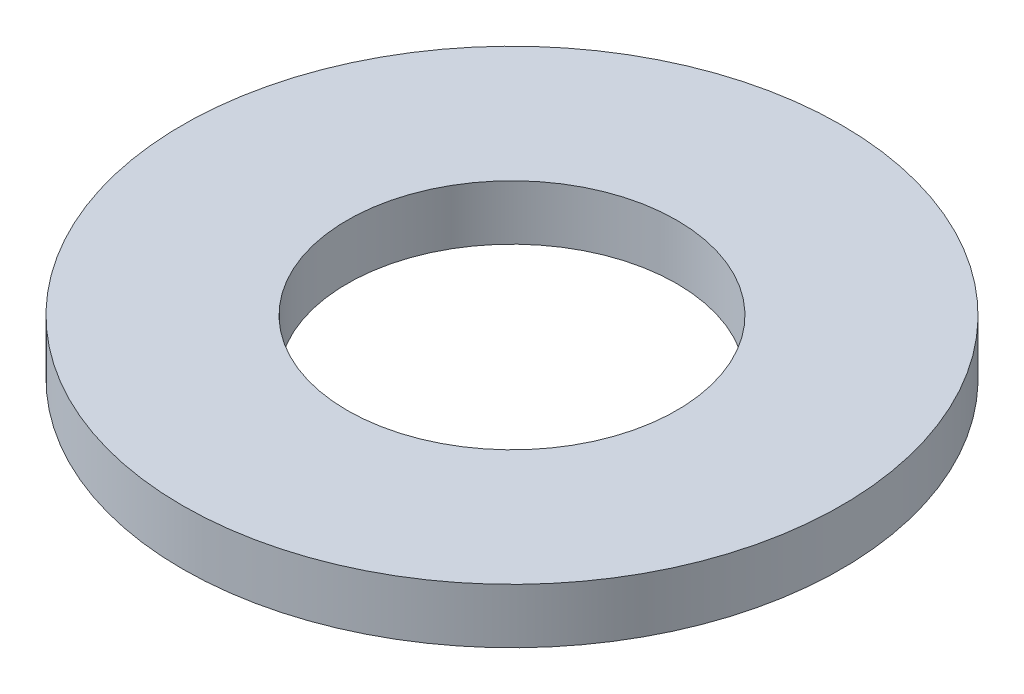
ISO-10303-21;
HEADER;
FILE_DESCRIPTION(('STEP AP214'),'2;1');
FILE_NAME('part.step','',(''),(''),'','','');
FILE_SCHEMA(('AUTOMOTIVE_DESIGN { 1 0 10303 214 1 1 1 1 }'));
ENDSEC;
DATA;
#1=APPLICATION_CONTEXT('core data for automotive mechanical design processes');
#2=APPLICATION_PROTOCOL_DEFINITION('international standard','automotive_design',2000,#1);
#3=PRODUCT_CONTEXT('',#1,'mechanical');
#4=PRODUCT('Part','Part','',(#3));
#5=PRODUCT_RELATED_PRODUCT_CATEGORY('part','',(#4));
#6=PRODUCT_DEFINITION_FORMATION('','',#4);
#7=PRODUCT_DEFINITION_CONTEXT('part definition',#1,'design');
#8=PRODUCT_DEFINITION('design','',#6,#7);
#9=PRODUCT_DEFINITION_SHAPE('','',#8);
#10=(LENGTH_UNIT() NAMED_UNIT(*) SI_UNIT(.MILLI.,.METRE.));
#11=(NAMED_UNIT(*) PLANE_ANGLE_UNIT() SI_UNIT($,.RADIAN.));
#12=(NAMED_UNIT(*) SI_UNIT($,.STERADIAN.) SOLID_ANGLE_UNIT());
#13=UNCERTAINTY_MEASURE_WITH_UNIT(LENGTH_MEASURE(1.E-05),#10,'distance_accuracy_value','');
#14=(GEOMETRIC_REPRESENTATION_CONTEXT(3) GLOBAL_UNCERTAINTY_ASSIGNED_CONTEXT((#13)) GLOBAL_UNIT_ASSIGNED_CONTEXT((#10,
#11,#12)) REPRESENTATION_CONTEXT('',''));
#15=CARTESIAN_POINT('',(0.,0.,0.));
#16=DIRECTION('',(0.,0.,1.));
#17=DIRECTION('',(1.,0.,0.));
#18=AXIS2_PLACEMENT_3D('',#15,#16,#17);
#19=CARTESIAN_POINT('',(0.,0.5,0.));
#20=DIRECTION('',(0.,1.,0.));
#21=DIRECTION('',(0.,0.,1.));
#22=AXIS2_PLACEMENT_3D('',#19,#20,#21);
#23=PLANE('',#22);
#24=CARTESIAN_POINT('',(0.,0.5,0.));
#25=DIRECTION('',(0.,1.,0.));
#26=DIRECTION('',(0.,0.,1.));
#27=AXIS2_PLACEMENT_3D('',#24,#25,#26);
#28=CIRCLE('',#27,3.);
#29=CARTESIAN_POINT('',(0.,0.5,3.));
#30=VERTEX_POINT('',#29);
#31=EDGE_CURVE('E10',#30,#30,#28,.T.);
#32=ORIENTED_EDGE('',*,*,#31,.T.);
#33=EDGE_LOOP('',(#32));
#34=FACE_BOUND('',#33,.T.);
#35=CARTESIAN_POINT('',(0.,0.5,0.));
#36=DIRECTION('',(0.,1.,0.));
#37=DIRECTION('',(0.,0.,1.));
#38=AXIS2_PLACEMENT_3D('',#35,#36,#37);
#39=CIRCLE('',#38,1.5);
#40=CARTESIAN_POINT('',(0.,0.5,1.5));
#41=VERTEX_POINT('',#40);
#42=EDGE_CURVE('E56',#41,#41,#39,.T.);
#43=ORIENTED_EDGE('',*,*,#42,.F.);
#44=EDGE_LOOP('',(#43));
#45=FACE_BOUND('',#44,.T.);
#46=ADVANCED_FACE('F43',(#34,#45),#23,.T.);
#47=CARTESIAN_POINT('',(0.,0.,0.));
#48=DIRECTION('',(0.,1.,0.));
#49=DIRECTION('',(0.,0.,1.));
#50=AXIS2_PLACEMENT_3D('',#47,#48,#49);
#51=PLANE('',#50);
#52=CARTESIAN_POINT('',(0.,0.,0.));
#53=DIRECTION('',(0.,1.,0.));
#54=DIRECTION('',(0.,0.,1.));
#55=AXIS2_PLACEMENT_3D('',#52,#53,#54);
#56=CIRCLE('',#55,3.);
#57=CARTESIAN_POINT('',(0.,0.,3.));
#58=VERTEX_POINT('',#57);
#59=EDGE_CURVE('E47',#58,#58,#56,.T.);
#60=ORIENTED_EDGE('',*,*,#59,.F.);
#61=EDGE_LOOP('',(#60));
#62=FACE_BOUND('',#61,.T.);
#63=CARTESIAN_POINT('',(0.,0.,0.));
#64=DIRECTION('',(0.,1.,0.));
#65=DIRECTION('',(0.,0.,1.));
#66=AXIS2_PLACEMENT_3D('',#63,#64,#65);
#67=CIRCLE('',#66,1.5);
#68=CARTESIAN_POINT('',(0.,0.,1.5));
#69=VERTEX_POINT('',#68);
#70=EDGE_CURVE('E58',#69,#69,#67,.T.);
#71=ORIENTED_EDGE('',*,*,#70,.T.);
#72=EDGE_LOOP('',(#71));
#73=FACE_BOUND('',#72,.T.);
#74=ADVANCED_FACE('F70',(#62,#73),#51,.F.);
#75=CARTESIAN_POINT('',(0.,0.5,0.));
#76=DIRECTION('',(0.,-1.,0.));
#77=DIRECTION('',(0.,0.,-1.));
#78=AXIS2_PLACEMENT_3D('',#75,#76,#77);
#79=CYLINDRICAL_SURFACE('',#78,3.);
#80=ORIENTED_EDGE('',*,*,#31,.F.);
#81=EDGE_LOOP('',(#80));
#82=FACE_BOUND('',#81,.T.);
#83=ORIENTED_EDGE('',*,*,#59,.T.);
#84=EDGE_LOOP('',(#83));
#85=FACE_BOUND('',#84,.T.);
#86=ADVANCED_FACE('F45',(#82,#85),#79,.T.);
#87=CARTESIAN_POINT('',(0.,0.5,0.));
#88=DIRECTION('',(0.,-1.,0.));
#89=DIRECTION('',(0.,0.,-1.));
#90=AXIS2_PLACEMENT_3D('',#87,#88,#89);
#91=CYLINDRICAL_SURFACE('',#90,1.5);
#92=ORIENTED_EDGE('',*,*,#42,.T.);
#93=EDGE_LOOP('',(#92));
#94=FACE_BOUND('',#93,.T.);
#95=ORIENTED_EDGE('',*,*,#70,.F.);
#96=EDGE_LOOP('',(#95));
#97=FACE_BOUND('',#96,.T.);
#98=ADVANCED_FACE('F66',(#94,#97),#91,.F.);
#99=CLOSED_SHELL('',(#46,#74,#86,#98));
#100=MANIFOLD_SOLID_BREP('B2',#99);
#101=ADVANCED_BREP_SHAPE_REPRESENTATION('',(#18,#100),#14);
#102=SHAPE_DEFINITION_REPRESENTATION(#9,#101);
ENDSEC;
END-ISO-10303-21;
